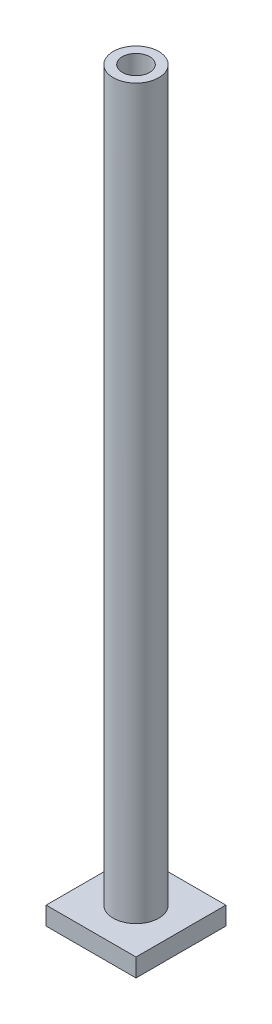
ISO-10303-21;
HEADER;
FILE_DESCRIPTION(('STEP AP214'),'2;1');
FILE_NAME('part.step','',(''),(''),'','','');
FILE_SCHEMA(('AUTOMOTIVE_DESIGN { 1 0 10303 214 1 1 1 1 }'));
ENDSEC;
DATA;
#1=APPLICATION_CONTEXT('core data for automotive mechanical design processes');
#2=APPLICATION_PROTOCOL_DEFINITION('international standard','automotive_design',2000,#1);
#3=PRODUCT_CONTEXT('',#1,'mechanical');
#4=PRODUCT('Part','Part','',(#3));
#5=PRODUCT_RELATED_PRODUCT_CATEGORY('part','',(#4));
#6=PRODUCT_DEFINITION_FORMATION('','',#4);
#7=PRODUCT_DEFINITION_CONTEXT('part definition',#1,'design');
#8=PRODUCT_DEFINITION('design','',#6,#7);
#9=PRODUCT_DEFINITION_SHAPE('','',#8);
#10=(LENGTH_UNIT() NAMED_UNIT(*) SI_UNIT(.MILLI.,.METRE.));
#11=(NAMED_UNIT(*) PLANE_ANGLE_UNIT() SI_UNIT($,.RADIAN.));
#12=(NAMED_UNIT(*) SI_UNIT($,.STERADIAN.) SOLID_ANGLE_UNIT());
#13=UNCERTAINTY_MEASURE_WITH_UNIT(LENGTH_MEASURE(1.E-05),#10,'distance_accuracy_value','');
#14=(GEOMETRIC_REPRESENTATION_CONTEXT(3) GLOBAL_UNCERTAINTY_ASSIGNED_CONTEXT((#13)) GLOBAL_UNIT_ASSIGNED_CONTEXT((#10,
#11,#12)) REPRESENTATION_CONTEXT('',''));
#15=CARTESIAN_POINT('',(0.,0.,0.));
#16=DIRECTION('',(0.,0.,1.));
#17=DIRECTION('',(1.,0.,0.));
#18=AXIS2_PLACEMENT_3D('',#15,#16,#17);
#19=CARTESIAN_POINT('',(0.,0.,0.));
#20=DIRECTION('',(0.,-1.,0.));
#21=DIRECTION('',(0.,0.,-1.));
#22=AXIS2_PLACEMENT_3D('',#19,#20,#21);
#23=PLANE('',#22);
#24=DIRECTION('',(0.,0.,1.));
#25=VECTOR('',#24,1.);
#26=CARTESIAN_POINT('',(-7.9,0.,-7.9));
#27=LINE('',#26,#25);
#28=CARTESIAN_POINT('',(-7.9,0.,-7.9));
#29=VERTEX_POINT('',#28);
#30=CARTESIAN_POINT('',(-7.9,0.,7.9));
#31=VERTEX_POINT('',#30);
#32=EDGE_CURVE('E170',#29,#31,#27,.T.);
#33=ORIENTED_EDGE('',*,*,#32,.F.);
#34=DIRECTION('',(-1.,0.,0.));
#35=VECTOR('',#34,1.);
#36=CARTESIAN_POINT('',(7.9,0.,-7.9));
#37=LINE('',#36,#35);
#38=CARTESIAN_POINT('',(7.9,0.,-7.9));
#39=VERTEX_POINT('',#38);
#40=EDGE_CURVE('E95',#39,#29,#37,.T.);
#41=ORIENTED_EDGE('',*,*,#40,.F.);
#42=DIRECTION('',(0.,0.,-1.));
#43=VECTOR('',#42,1.);
#44=CARTESIAN_POINT('',(7.9,0.,-7.9));
#45=LINE('',#44,#43);
#46=CARTESIAN_POINT('',(7.9,0.,7.9));
#47=VERTEX_POINT('',#46);
#48=EDGE_CURVE('E182',#47,#39,#45,.T.);
#49=ORIENTED_EDGE('',*,*,#48,.F.);
#50=DIRECTION('',(1.,0.,0.));
#51=VECTOR('',#50,1.);
#52=CARTESIAN_POINT('',(7.9,0.,7.9));
#53=LINE('',#52,#51);
#54=EDGE_CURVE('E180',#31,#47,#53,.T.);
#55=ORIENTED_EDGE('',*,*,#54,.F.);
#56=EDGE_LOOP('',(#33,#41,#49,#55));
#57=FACE_BOUND('',#56,.T.);
#58=DIRECTION('',(0.,0.,-1.));
#59=VECTOR('',#58,1.);
#60=CARTESIAN_POINT('',(6.6,0.,0.));
#61=LINE('',#60,#59);
#62=CARTESIAN_POINT('',(6.6,0.,6.6));
#63=VERTEX_POINT('',#62);
#64=CARTESIAN_POINT('',(6.6,0.,-6.6));
#65=VERTEX_POINT('',#64);
#66=EDGE_CURVE('E148',#63,#65,#61,.T.);
#67=ORIENTED_EDGE('',*,*,#66,.T.);
#68=DIRECTION('',(-1.,0.,0.));
#69=VECTOR('',#68,1.);
#70=CARTESIAN_POINT('',(0.,0.,-6.6));
#71=LINE('',#70,#69);
#72=CARTESIAN_POINT('',(-6.6,0.,-6.6));
#73=VERTEX_POINT('',#72);
#74=EDGE_CURVE('E131',#65,#73,#71,.T.);
#75=ORIENTED_EDGE('',*,*,#74,.T.);
#76=DIRECTION('',(0.,0.,-1.));
#77=VECTOR('',#76,1.);
#78=CARTESIAN_POINT('',(-6.6,0.,0.));
#79=LINE('',#78,#77);
#80=CARTESIAN_POINT('',(-6.6,0.,6.6));
#81=VERTEX_POINT('',#80);
#82=EDGE_CURVE('E141',#81,#73,#79,.T.);
#83=ORIENTED_EDGE('',*,*,#82,.F.);
#84=DIRECTION('',(-1.,0.,0.));
#85=VECTOR('',#84,1.);
#86=CARTESIAN_POINT('',(0.,0.,6.6));
#87=LINE('',#86,#85);
#88=EDGE_CURVE('E65',#63,#81,#87,.T.);
#89=ORIENTED_EDGE('',*,*,#88,.F.);
#90=EDGE_LOOP('',(#67,#75,#83,#89));
#91=FACE_BOUND('',#90,.T.);
#92=ADVANCED_FACE('F50',(#57,#91),#23,.T.);
#93=CARTESIAN_POINT('',(-7.9,3.2,-7.9));
#94=DIRECTION('',(1.,0.,0.));
#95=DIRECTION('',(0.,0.,-1.));
#96=AXIS2_PLACEMENT_3D('',#93,#94,#95);
#97=PLANE('',#96);
#98=ORIENTED_EDGE('',*,*,#32,.T.);
#99=DIRECTION('',(0.,-1.,0.));
#100=VECTOR('',#99,1.);
#101=CARTESIAN_POINT('',(-7.9,3.2,7.9));
#102=LINE('',#101,#100);
#103=CARTESIAN_POINT('',(-7.9,3.2,7.9));
#104=VERTEX_POINT('',#103);
#105=EDGE_CURVE('E58',#104,#31,#102,.T.);
#106=ORIENTED_EDGE('',*,*,#105,.F.);
#107=DIRECTION('',(0.,0.,1.));
#108=VECTOR('',#107,1.);
#109=CARTESIAN_POINT('',(-7.9,3.2,-7.9));
#110=LINE('',#109,#108);
#111=CARTESIAN_POINT('',(-7.9,3.2,-7.9));
#112=VERTEX_POINT('',#111);
#113=EDGE_CURVE('E171',#112,#104,#110,.T.);
#114=ORIENTED_EDGE('',*,*,#113,.F.);
#115=DIRECTION('',(0.,-1.,0.));
#116=VECTOR('',#115,1.);
#117=CARTESIAN_POINT('',(-7.9,3.2,-7.9));
#118=LINE('',#117,#116);
#119=EDGE_CURVE('E177',#112,#29,#118,.T.);
#120=ORIENTED_EDGE('',*,*,#119,.T.);
#121=EDGE_LOOP('',(#98,#106,#114,#120));
#122=FACE_BOUND('',#121,.T.);
#123=ADVANCED_FACE('F52',(#122),#97,.F.);
#124=CARTESIAN_POINT('',(7.9,3.2,7.9));
#125=DIRECTION('',(0.,0.,-1.));
#126=DIRECTION('',(-1.,0.,0.));
#127=AXIS2_PLACEMENT_3D('',#124,#125,#126);
#128=PLANE('',#127);
#129=ORIENTED_EDGE('',*,*,#54,.T.);
#130=DIRECTION('',(0.,-1.,0.));
#131=VECTOR('',#130,1.);
#132=CARTESIAN_POINT('',(7.9,3.2,7.9));
#133=LINE('',#132,#131);
#134=CARTESIAN_POINT('',(7.9,3.2,7.9));
#135=VERTEX_POINT('',#134);
#136=EDGE_CURVE('E188',#135,#47,#133,.T.);
#137=ORIENTED_EDGE('',*,*,#136,.F.);
#138=DIRECTION('',(1.,0.,0.));
#139=VECTOR('',#138,1.);
#140=CARTESIAN_POINT('',(7.9,3.2,7.9));
#141=LINE('',#140,#139);
#142=EDGE_CURVE('E103',#104,#135,#141,.T.);
#143=ORIENTED_EDGE('',*,*,#142,.F.);
#144=ORIENTED_EDGE('',*,*,#105,.T.);
#145=EDGE_LOOP('',(#129,#137,#143,#144));
#146=FACE_BOUND('',#145,.T.);
#147=ADVANCED_FACE('F191',(#146),#128,.F.);
#148=CARTESIAN_POINT('',(7.9,3.2,-7.9));
#149=DIRECTION('',(-1.,0.,0.));
#150=DIRECTION('',(0.,0.,1.));
#151=AXIS2_PLACEMENT_3D('',#148,#149,#150);
#152=PLANE('',#151);
#153=ORIENTED_EDGE('',*,*,#48,.T.);
#154=DIRECTION('',(0.,-1.,0.));
#155=VECTOR('',#154,1.);
#156=CARTESIAN_POINT('',(7.9,3.2,-7.9));
#157=LINE('',#156,#155);
#158=CARTESIAN_POINT('',(7.9,3.2,-7.9));
#159=VERTEX_POINT('',#158);
#160=EDGE_CURVE('E186',#159,#39,#157,.T.);
#161=ORIENTED_EDGE('',*,*,#160,.F.);
#162=DIRECTION('',(0.,0.,-1.));
#163=VECTOR('',#162,1.);
#164=CARTESIAN_POINT('',(7.9,3.2,-7.9));
#165=LINE('',#164,#163);
#166=EDGE_CURVE('E174',#135,#159,#165,.T.);
#167=ORIENTED_EDGE('',*,*,#166,.F.);
#168=ORIENTED_EDGE('',*,*,#136,.T.);
#169=EDGE_LOOP('',(#153,#161,#167,#168));
#170=FACE_BOUND('',#169,.T.);
#171=ADVANCED_FACE('F199',(#170),#152,.F.);
#172=CARTESIAN_POINT('',(7.9,3.2,-7.9));
#173=DIRECTION('',(0.,0.,1.));
#174=DIRECTION('',(1.,0.,0.));
#175=AXIS2_PLACEMENT_3D('',#172,#173,#174);
#176=PLANE('',#175);
#177=ORIENTED_EDGE('',*,*,#40,.T.);
#178=ORIENTED_EDGE('',*,*,#119,.F.);
#179=DIRECTION('',(-1.,0.,0.));
#180=VECTOR('',#179,1.);
#181=CARTESIAN_POINT('',(7.9,3.2,-7.9));
#182=LINE('',#181,#180);
#183=EDGE_CURVE('E74',#159,#112,#182,.T.);
#184=ORIENTED_EDGE('',*,*,#183,.F.);
#185=ORIENTED_EDGE('',*,*,#160,.T.);
#186=EDGE_LOOP('',(#177,#178,#184,#185));
#187=FACE_BOUND('',#186,.T.);
#188=ADVANCED_FACE('F201',(#187),#176,.F.);
#189=CARTESIAN_POINT('',(0.,3.2,0.));
#190=DIRECTION('',(0.,-1.,0.));
#191=DIRECTION('',(0.,0.,-1.));
#192=AXIS2_PLACEMENT_3D('',#189,#190,#191);
#193=PLANE('',#192);
#194=CARTESIAN_POINT('',(0.,3.20000000000001,0.));
#195=DIRECTION('',(0.,-1.,0.));
#196=DIRECTION('',(0.,0.,-1.));
#197=AXIS2_PLACEMENT_3D('',#194,#195,#196);
#198=CIRCLE('',#197,4.);
#199=CARTESIAN_POINT('',(0.,3.20000000000001,-4.));
#200=VERTEX_POINT('',#199);
#201=EDGE_CURVE('E13',#200,#200,#198,.F.);
#202=ORIENTED_EDGE('',*,*,#201,.F.);
#203=EDGE_LOOP('',(#202));
#204=FACE_BOUND('',#203,.T.);
#205=ORIENTED_EDGE('',*,*,#113,.T.);
#206=ORIENTED_EDGE('',*,*,#142,.T.);
#207=ORIENTED_EDGE('',*,*,#166,.T.);
#208=ORIENTED_EDGE('',*,*,#183,.T.);
#209=EDGE_LOOP('',(#205,#206,#207,#208));
#210=FACE_BOUND('',#209,.T.);
#211=ADVANCED_FACE('F202',(#204,#210),#193,.F.);
#212=CARTESIAN_POINT('',(0.,21.8676190233249,-6.6));
#213=DIRECTION('',(0.,0.,1.));
#214=DIRECTION('',(1.,0.,0.));
#215=AXIS2_PLACEMENT_3D('',#212,#213,#214);
#216=PLANE('',#215);
#217=DIRECTION('',(0.,-1.,0.));
#218=VECTOR('',#217,1.);
#219=CARTESIAN_POINT('',(-6.6,21.8676190233249,-6.6));
#220=LINE('',#219,#218);
#221=CARTESIAN_POINT('',(-6.6,2.,-6.6));
#222=VERTEX_POINT('',#221);
#223=EDGE_CURVE('E126',#222,#73,#220,.T.);
#224=ORIENTED_EDGE('',*,*,#223,.T.);
#225=ORIENTED_EDGE('',*,*,#74,.F.);
#226=DIRECTION('',(0.,-1.,0.));
#227=VECTOR('',#226,1.);
#228=CARTESIAN_POINT('',(6.6,21.8676190233249,-6.6));
#229=LINE('',#228,#227);
#230=CARTESIAN_POINT('',(6.6,2.,-6.6));
#231=VERTEX_POINT('',#230);
#232=EDGE_CURVE('E137',#231,#65,#229,.T.);
#233=ORIENTED_EDGE('',*,*,#232,.F.);
#234=DIRECTION('',(1.,0.,0.));
#235=VECTOR('',#234,1.);
#236=CARTESIAN_POINT('',(0.,2.,-6.6));
#237=LINE('',#236,#235);
#238=EDGE_CURVE('E134',#222,#231,#237,.T.);
#239=ORIENTED_EDGE('',*,*,#238,.F.);
#240=EDGE_LOOP('',(#224,#225,#233,#239));
#241=FACE_BOUND('',#240,.T.);
#242=ADVANCED_FACE('F128',(#241),#216,.T.);
#243=CARTESIAN_POINT('',(6.6,21.8676190233249,0.));
#244=DIRECTION('',(-1.,0.,0.));
#245=DIRECTION('',(0.,0.,1.));
#246=AXIS2_PLACEMENT_3D('',#243,#244,#245);
#247=PLANE('',#246);
#248=ORIENTED_EDGE('',*,*,#232,.T.);
#249=ORIENTED_EDGE('',*,*,#66,.F.);
#250=DIRECTION('',(0.,-1.,0.));
#251=VECTOR('',#250,1.);
#252=CARTESIAN_POINT('',(6.6,21.8676190233249,6.6));
#253=LINE('',#252,#251);
#254=CARTESIAN_POINT('',(6.6,2.,6.6));
#255=VERTEX_POINT('',#254);
#256=EDGE_CURVE('E157',#255,#63,#253,.T.);
#257=ORIENTED_EDGE('',*,*,#256,.F.);
#258=DIRECTION('',(0.,0.,1.));
#259=VECTOR('',#258,1.);
#260=CARTESIAN_POINT('',(6.6,2.,0.));
#261=LINE('',#260,#259);
#262=EDGE_CURVE('E278',#231,#255,#261,.T.);
#263=ORIENTED_EDGE('',*,*,#262,.F.);
#264=EDGE_LOOP('',(#248,#249,#257,#263));
#265=FACE_BOUND('',#264,.T.);
#266=ADVANCED_FACE('F210',(#265),#247,.T.);
#267=CARTESIAN_POINT('',(0.,21.8676190233249,6.6));
#268=DIRECTION('',(0.,0.,1.));
#269=DIRECTION('',(1.,0.,0.));
#270=AXIS2_PLACEMENT_3D('',#267,#268,#269);
#271=PLANE('',#270);
#272=DIRECTION('',(1.,0.,0.));
#273=VECTOR('',#272,1.);
#274=CARTESIAN_POINT('',(0.,2.,6.6));
#275=LINE('',#274,#273);
#276=CARTESIAN_POINT('',(-6.6,2.,6.6));
#277=VERTEX_POINT('',#276);
#278=EDGE_CURVE('E281',#277,#255,#275,.T.);
#279=ORIENTED_EDGE('',*,*,#278,.T.);
#280=ORIENTED_EDGE('',*,*,#256,.T.);
#281=ORIENTED_EDGE('',*,*,#88,.T.);
#282=DIRECTION('',(0.,-1.,0.));
#283=VECTOR('',#282,1.);
#284=CARTESIAN_POINT('',(-6.6,21.8676190233249,6.6));
#285=LINE('',#284,#283);
#286=EDGE_CURVE('E143',#277,#81,#285,.T.);
#287=ORIENTED_EDGE('',*,*,#286,.F.);
#288=EDGE_LOOP('',(#279,#280,#281,#287));
#289=FACE_BOUND('',#288,.T.);
#290=ADVANCED_FACE('F249',(#289),#271,.F.);
#291=CARTESIAN_POINT('',(-6.6,21.8676190233249,0.));
#292=DIRECTION('',(-1.,0.,0.));
#293=DIRECTION('',(0.,0.,1.));
#294=AXIS2_PLACEMENT_3D('',#291,#292,#293);
#295=PLANE('',#294);
#296=DIRECTION('',(0.,0.,1.));
#297=VECTOR('',#296,1.);
#298=CARTESIAN_POINT('',(-6.6,2.,0.));
#299=LINE('',#298,#297);
#300=EDGE_CURVE('E164',#222,#277,#299,.T.);
#301=ORIENTED_EDGE('',*,*,#300,.T.);
#302=ORIENTED_EDGE('',*,*,#286,.T.);
#303=ORIENTED_EDGE('',*,*,#82,.T.);
#304=ORIENTED_EDGE('',*,*,#223,.F.);
#305=EDGE_LOOP('',(#301,#302,#303,#304));
#306=FACE_BOUND('',#305,.T.);
#307=ADVANCED_FACE('F142',(#306),#295,.F.);
#308=CARTESIAN_POINT('',(0.,21.8676190233249,0.));
#309=DIRECTION('',(0.,-1.,0.));
#310=DIRECTION('',(0.,0.,-1.));
#311=AXIS2_PLACEMENT_3D('',#308,#309,#310);
#312=CYLINDRICAL_SURFACE('',#311,3.4);
#313=CARTESIAN_POINT('',(0.,2.,0.));
#314=DIRECTION('',(0.,-1.,0.));
#315=DIRECTION('',(0.,0.,-1.));
#316=AXIS2_PLACEMENT_3D('',#313,#314,#315);
#317=CIRCLE('',#316,3.4);
#318=CARTESIAN_POINT('',(0.,2.,-3.4));
#319=VERTEX_POINT('',#318);
#320=EDGE_CURVE('E160',#319,#319,#317,.F.);
#321=ORIENTED_EDGE('',*,*,#320,.F.);
#322=EDGE_LOOP('',(#321));
#323=FACE_BOUND('',#322,.T.);
#324=CARTESIAN_POINT('',(0.,0.,0.));
#325=DIRECTION('',(0.,-1.,0.));
#326=DIRECTION('',(0.,0.,-1.));
#327=AXIS2_PLACEMENT_3D('',#324,#325,#326);
#328=CIRCLE('',#327,3.4);
#329=CARTESIAN_POINT('',(0.,0.,-3.4));
#330=VERTEX_POINT('',#329);
#331=EDGE_CURVE('E138',#330,#330,#328,.T.);
#332=ORIENTED_EDGE('',*,*,#331,.F.);
#333=EDGE_LOOP('',(#332));
#334=FACE_BOUND('',#333,.T.);
#335=ADVANCED_FACE('F238',(#323,#334),#312,.T.);
#336=CARTESIAN_POINT('',(0.,2.,0.));
#337=DIRECTION('',(0.,-1.,0.));
#338=DIRECTION('',(0.,0.,-1.));
#339=AXIS2_PLACEMENT_3D('',#336,#337,#338);
#340=PLANE('',#339);
#341=ORIENTED_EDGE('',*,*,#300,.F.);
#342=ORIENTED_EDGE('',*,*,#238,.T.);
#343=ORIENTED_EDGE('',*,*,#262,.T.);
#344=ORIENTED_EDGE('',*,*,#278,.F.);
#345=EDGE_LOOP('',(#341,#342,#343,#344));
#346=FACE_BOUND('',#345,.T.);
#347=ORIENTED_EDGE('',*,*,#320,.T.);
#348=EDGE_LOOP('',(#347));
#349=FACE_BOUND('',#348,.T.);
#350=ADVANCED_FACE('F240',(#346,#349),#340,.T.);
#351=CARTESIAN_POINT('',(0.,2.,0.));
#352=DIRECTION('',(0.,-1.,0.));
#353=DIRECTION('',(0.,0.,-1.));
#354=AXIS2_PLACEMENT_3D('',#351,#352,#353);
#355=PLANE('',#354);
#356=CARTESIAN_POINT('',(0.,2.,0.));
#357=DIRECTION('',(0.,-1.,0.));
#358=DIRECTION('',(0.,0.,-1.));
#359=AXIS2_PLACEMENT_3D('',#356,#357,#358);
#360=CIRCLE('',#359,2.4);
#361=CARTESIAN_POINT('',(0.,2.,-2.4));
#362=VERTEX_POINT('',#361);
#363=EDGE_CURVE('E266',#362,#362,#360,.F.);
#364=ORIENTED_EDGE('',*,*,#363,.T.);
#365=EDGE_LOOP('',(#364));
#366=FACE_BOUND('',#365,.T.);
#367=CARTESIAN_POINT('',(0.,2.,0.));
#368=DIRECTION('',(0.,-1.,0.));
#369=DIRECTION('',(0.,0.,-1.));
#370=AXIS2_PLACEMENT_3D('',#367,#368,#369);
#371=CIRCLE('',#370,2.5);
#372=CARTESIAN_POINT('',(0.,2.,-2.5));
#373=VERTEX_POINT('',#372);
#374=EDGE_CURVE('E167',#373,#373,#371,.F.);
#375=ORIENTED_EDGE('',*,*,#374,.F.);
#376=EDGE_LOOP('',(#375));
#377=FACE_BOUND('',#376,.T.);
#378=ADVANCED_FACE('F232',(#366,#377),#355,.T.);
#379=CARTESIAN_POINT('',(0.,21.8676190233249,0.));
#380=DIRECTION('',(0.,-1.,0.));
#381=DIRECTION('',(0.,0.,-1.));
#382=AXIS2_PLACEMENT_3D('',#379,#380,#381);
#383=CYLINDRICAL_SURFACE('',#382,2.5);
#384=ORIENTED_EDGE('',*,*,#374,.T.);
#385=EDGE_LOOP('',(#384));
#386=FACE_BOUND('',#385,.T.);
#387=CARTESIAN_POINT('',(0.,0.,0.));
#388=DIRECTION('',(0.,-1.,0.));
#389=DIRECTION('',(0.,0.,-1.));
#390=AXIS2_PLACEMENT_3D('',#387,#388,#389);
#391=CIRCLE('',#390,2.5);
#392=CARTESIAN_POINT('',(0.,0.,-2.5));
#393=VERTEX_POINT('',#392);
#394=EDGE_CURVE('E163',#393,#393,#391,.T.);
#395=ORIENTED_EDGE('',*,*,#394,.T.);
#396=EDGE_LOOP('',(#395));
#397=FACE_BOUND('',#396,.T.);
#398=ADVANCED_FACE('F223',(#386,#397),#383,.F.);
#399=ORIENTED_EDGE('',*,*,#394,.F.);
#400=EDGE_LOOP('',(#399));
#401=FACE_BOUND('',#400,.T.);
#402=ORIENTED_EDGE('',*,*,#331,.T.);
#403=EDGE_LOOP('',(#402));
#404=FACE_BOUND('',#403,.T.);
#405=ADVANCED_FACE('F217',(#401,#404),#23,.T.);
#406=CARTESIAN_POINT('',(0.,131.2,0.));
#407=DIRECTION('',(0.,1.,0.));
#408=DIRECTION('',(0.,0.,1.));
#409=AXIS2_PLACEMENT_3D('',#406,#407,#408);
#410=PLANE('',#409);
#411=CARTESIAN_POINT('',(0.,131.2,0.));
#412=DIRECTION('',(0.,1.,0.));
#413=DIRECTION('',(0.,0.,1.));
#414=AXIS2_PLACEMENT_3D('',#411,#412,#413);
#415=CIRCLE('',#414,4.);
#416=CARTESIAN_POINT('',(0.,131.2,4.));
#417=VERTEX_POINT('',#416);
#418=EDGE_CURVE('E145',#417,#417,#415,.T.);
#419=ORIENTED_EDGE('',*,*,#418,.T.);
#420=EDGE_LOOP('',(#419));
#421=FACE_BOUND('',#420,.T.);
#422=CARTESIAN_POINT('',(0.,131.2,0.));
#423=DIRECTION('',(0.,1.,0.));
#424=DIRECTION('',(0.,0.,1.));
#425=AXIS2_PLACEMENT_3D('',#422,#423,#424);
#426=CIRCLE('',#425,2.4);
#427=CARTESIAN_POINT('',(0.,131.2,2.4));
#428=VERTEX_POINT('',#427);
#429=EDGE_CURVE('E270',#428,#428,#426,.T.);
#430=ORIENTED_EDGE('',*,*,#429,.F.);
#431=EDGE_LOOP('',(#430));
#432=FACE_BOUND('',#431,.T.);
#433=ADVANCED_FACE('F222',(#421,#432),#410,.T.);
#434=CARTESIAN_POINT('',(0.,131.2,0.));
#435=DIRECTION('',(0.,-1.,0.));
#436=DIRECTION('',(0.,0.,-1.));
#437=AXIS2_PLACEMENT_3D('',#434,#435,#436);
#438=CYLINDRICAL_SURFACE('',#437,4.);
#439=ORIENTED_EDGE('',*,*,#418,.F.);
#440=EDGE_LOOP('',(#439));
#441=FACE_BOUND('',#440,.T.);
#442=ORIENTED_EDGE('',*,*,#201,.T.);
#443=EDGE_LOOP('',(#442));
#444=FACE_BOUND('',#443,.T.);
#445=ADVANCED_FACE('F229',(#441,#444),#438,.T.);
#446=CARTESIAN_POINT('',(0.,131.2,0.));
#447=DIRECTION('',(0.,-1.,0.));
#448=DIRECTION('',(0.,0.,-1.));
#449=AXIS2_PLACEMENT_3D('',#446,#447,#448);
#450=CYLINDRICAL_SURFACE('',#449,2.4);
#451=ORIENTED_EDGE('',*,*,#429,.T.);
#452=EDGE_LOOP('',(#451));
#453=FACE_BOUND('',#452,.T.);
#454=ORIENTED_EDGE('',*,*,#363,.F.);
#455=EDGE_LOOP('',(#454));
#456=FACE_BOUND('',#455,.T.);
#457=ADVANCED_FACE('F290',(#453,#456),#450,.F.);
#458=CLOSED_SHELL('',(#92,#123,#147,#171,#188,#211,#242,#266,#290,#307,#335,#350,#378,#398,#405,
#433,#445,#457));
#459=MANIFOLD_SOLID_BREP('B2',#458);
#460=ADVANCED_BREP_SHAPE_REPRESENTATION('',(#18,#459),#14);
#461=SHAPE_DEFINITION_REPRESENTATION(#9,#460);
ENDSEC;
END-ISO-10303-21;
